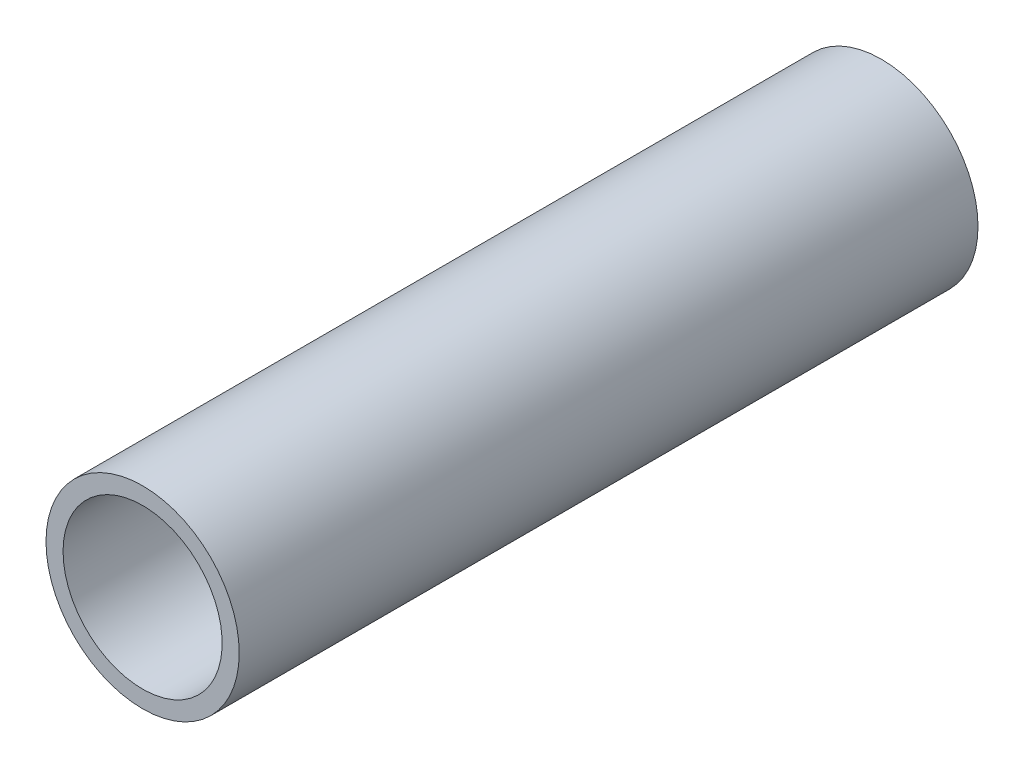
ISO-10303-21;
HEADER;
FILE_DESCRIPTION(('STEP AP214'),'2;1');
FILE_NAME('part.step','',(''),(''),'','','');
FILE_SCHEMA(('AUTOMOTIVE_DESIGN { 1 0 10303 214 1 1 1 1 }'));
ENDSEC;
DATA;
#1=APPLICATION_CONTEXT('core data for automotive mechanical design processes');
#2=APPLICATION_PROTOCOL_DEFINITION('international standard','automotive_design',2000,#1);
#3=PRODUCT_CONTEXT('',#1,'mechanical');
#4=PRODUCT('Part','Part','',(#3));
#5=PRODUCT_RELATED_PRODUCT_CATEGORY('part','',(#4));
#6=PRODUCT_DEFINITION_FORMATION('','',#4);
#7=PRODUCT_DEFINITION_CONTEXT('part definition',#1,'design');
#8=PRODUCT_DEFINITION('design','',#6,#7);
#9=PRODUCT_DEFINITION_SHAPE('','',#8);
#10=(LENGTH_UNIT() NAMED_UNIT(*) SI_UNIT(.MILLI.,.METRE.));
#11=(NAMED_UNIT(*) PLANE_ANGLE_UNIT() SI_UNIT($,.RADIAN.));
#12=(NAMED_UNIT(*) SI_UNIT($,.STERADIAN.) SOLID_ANGLE_UNIT());
#13=UNCERTAINTY_MEASURE_WITH_UNIT(LENGTH_MEASURE(1.E-05),#10,'distance_accuracy_value','');
#14=(GEOMETRIC_REPRESENTATION_CONTEXT(3) GLOBAL_UNCERTAINTY_ASSIGNED_CONTEXT((#13)) GLOBAL_UNIT_ASSIGNED_CONTEXT((#10,
#11,#12)) REPRESENTATION_CONTEXT('',''));
#15=CARTESIAN_POINT('',(0.,0.,0.));
#16=DIRECTION('',(0.,0.,1.));
#17=DIRECTION('',(1.,0.,0.));
#18=AXIS2_PLACEMENT_3D('',#15,#16,#17);
#19=CARTESIAN_POINT('',(347.5,-25.9999999999994,108.083261120685));
#20=DIRECTION('',(0.,0.,-1.));
#21=DIRECTION('',(-1.,0.,0.));
#22=AXIS2_PLACEMENT_3D('',#19,#20,#21);
#23=CYLINDRICAL_SURFACE('',#22,17.);
#24=CARTESIAN_POINT('',(347.5,-25.9999999999994,39.9999999999999));
#25=DIRECTION('',(0.,0.,-1.));
#26=DIRECTION('',(-1.,0.,0.));
#27=AXIS2_PLACEMENT_3D('',#24,#25,#26);
#28=CIRCLE('',#27,17.);
#29=CARTESIAN_POINT('',(330.5,-25.9999999999994,39.9999999999999));
#30=VERTEX_POINT('',#29);
#31=EDGE_CURVE('E37',#30,#30,#28,.T.);
#32=ORIENTED_EDGE('',*,*,#31,.T.);
#33=EDGE_LOOP('',(#32));
#34=FACE_BOUND('',#33,.T.);
#35=CARTESIAN_POINT('',(347.5,-25.9999999999994,-90.0000000000001));
#36=DIRECTION('',(0.,0.,-1.));
#37=DIRECTION('',(-1.,0.,0.));
#38=AXIS2_PLACEMENT_3D('',#35,#36,#37);
#39=CIRCLE('',#38,17.);
#40=CARTESIAN_POINT('',(330.5,-25.9999999999994,-90.0000000000001));
#41=VERTEX_POINT('',#40);
#42=EDGE_CURVE('E45',#41,#41,#39,.F.);
#43=ORIENTED_EDGE('',*,*,#42,.T.);
#44=EDGE_LOOP('',(#43));
#45=FACE_BOUND('',#44,.T.);
#46=ADVANCED_FACE('F30',(#34,#45),#23,.T.);
#47=CARTESIAN_POINT('',(347.5,-25.9999999999994,108.083261120685));
#48=DIRECTION('',(0.,0.,-1.));
#49=DIRECTION('',(-1.,0.,0.));
#50=AXIS2_PLACEMENT_3D('',#47,#48,#49);
#51=CYLINDRICAL_SURFACE('',#50,14.);
#52=CARTESIAN_POINT('',(347.5,-25.9999999999994,39.9999999999999));
#53=DIRECTION('',(0.,0.,-1.));
#54=DIRECTION('',(-1.,0.,0.));
#55=AXIS2_PLACEMENT_3D('',#52,#53,#54);
#56=CIRCLE('',#55,14.);
#57=CARTESIAN_POINT('',(333.5,-25.9999999999994,39.9999999999999));
#58=VERTEX_POINT('',#57);
#59=EDGE_CURVE('E10',#58,#58,#56,.T.);
#60=ORIENTED_EDGE('',*,*,#59,.F.);
#61=EDGE_LOOP('',(#60));
#62=FACE_BOUND('',#61,.T.);
#63=CARTESIAN_POINT('',(347.5,-25.9999999999994,-90.0000000000001));
#64=DIRECTION('',(0.,0.,-1.));
#65=DIRECTION('',(-1.,0.,0.));
#66=AXIS2_PLACEMENT_3D('',#63,#64,#65);
#67=CIRCLE('',#66,14.);
#68=CARTESIAN_POINT('',(333.5,-25.9999999999994,-90.0000000000001));
#69=VERTEX_POINT('',#68);
#70=EDGE_CURVE('E41',#69,#69,#67,.F.);
#71=ORIENTED_EDGE('',*,*,#70,.F.);
#72=EDGE_LOOP('',(#71));
#73=FACE_BOUND('',#72,.T.);
#74=ADVANCED_FACE('F58',(#62,#73),#51,.F.);
#75=CARTESIAN_POINT('',(0.,665.,40.));
#76=DIRECTION('',(0.,0.,-1.));
#77=DIRECTION('',(-1.,0.,0.));
#78=AXIS2_PLACEMENT_3D('',#75,#76,#77);
#79=PLANE('',#78);
#80=ORIENTED_EDGE('',*,*,#59,.T.);
#81=EDGE_LOOP('',(#80));
#82=FACE_BOUND('',#81,.T.);
#83=ORIENTED_EDGE('',*,*,#31,.F.);
#84=EDGE_LOOP('',(#83));
#85=FACE_BOUND('',#84,.T.);
#86=ADVANCED_FACE('F32',(#82,#85),#79,.F.);
#87=CARTESIAN_POINT('',(0.,665.,-90.));
#88=DIRECTION('',(0.,0.,-1.));
#89=DIRECTION('',(-1.,0.,0.));
#90=AXIS2_PLACEMENT_3D('',#87,#88,#89);
#91=PLANE('',#90);
#92=ORIENTED_EDGE('',*,*,#42,.F.);
#93=EDGE_LOOP('',(#92));
#94=FACE_BOUND('',#93,.T.);
#95=ORIENTED_EDGE('',*,*,#70,.T.);
#96=EDGE_LOOP('',(#95));
#97=FACE_BOUND('',#96,.T.);
#98=ADVANCED_FACE('F52',(#94,#97),#91,.T.);
#99=CLOSED_SHELL('',(#46,#74,#86,#98));
#100=MANIFOLD_SOLID_BREP('B2',#99);
#101=ADVANCED_BREP_SHAPE_REPRESENTATION('',(#18,#100),#14);
#102=SHAPE_DEFINITION_REPRESENTATION(#9,#101);
ENDSEC;
END-ISO-10303-21;
